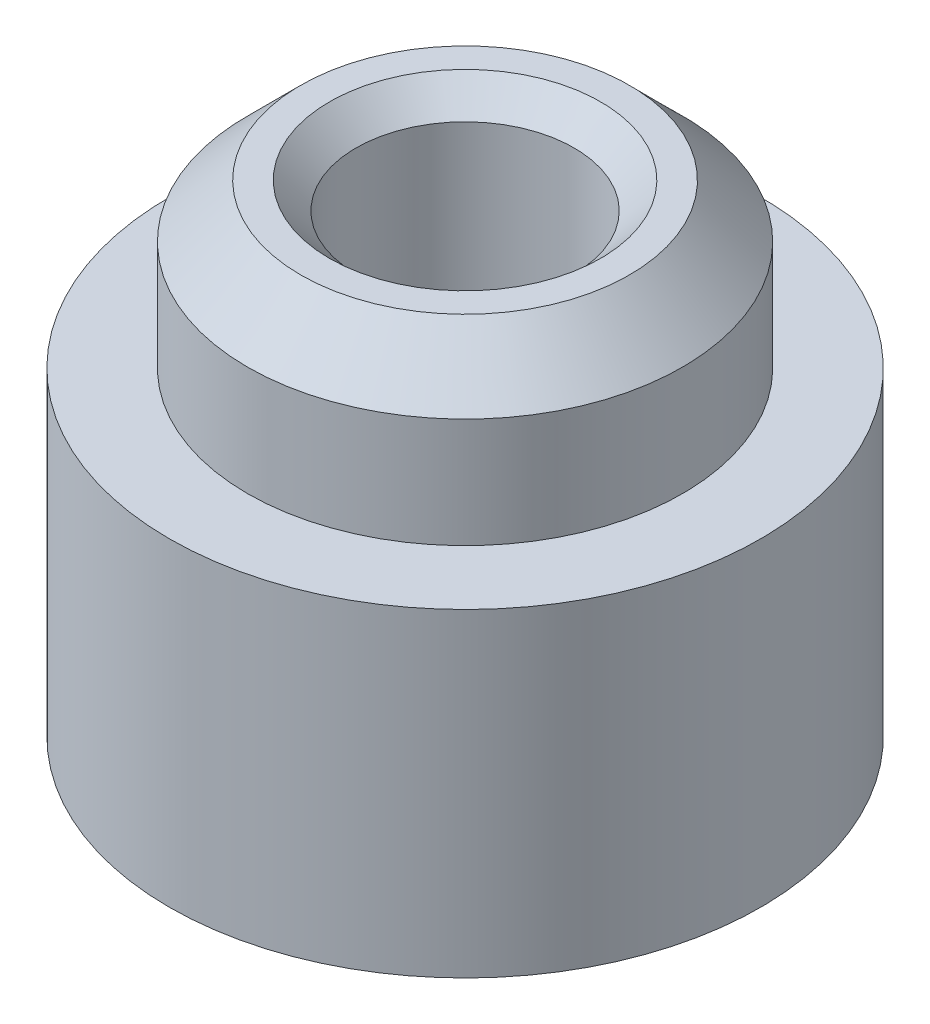
ISO-10303-21;
HEADER;
FILE_DESCRIPTION(('STEP AP214'),'2;1');
FILE_NAME('part.step','',(''),(''),'','','');
FILE_SCHEMA(('AUTOMOTIVE_DESIGN { 1 0 10303 214 1 1 1 1 }'));
ENDSEC;
DATA;
#1=APPLICATION_CONTEXT('core data for automotive mechanical design processes');
#2=APPLICATION_PROTOCOL_DEFINITION('international standard','automotive_design',2000,#1);
#3=PRODUCT_CONTEXT('',#1,'mechanical');
#4=PRODUCT('Part','Part','',(#3));
#5=PRODUCT_RELATED_PRODUCT_CATEGORY('part','',(#4));
#6=PRODUCT_DEFINITION_FORMATION('','',#4);
#7=PRODUCT_DEFINITION_CONTEXT('part definition',#1,'design');
#8=PRODUCT_DEFINITION('design','',#6,#7);
#9=PRODUCT_DEFINITION_SHAPE('','',#8);
#10=(LENGTH_UNIT() NAMED_UNIT(*) SI_UNIT(.MILLI.,.METRE.));
#11=(NAMED_UNIT(*) PLANE_ANGLE_UNIT() SI_UNIT($,.RADIAN.));
#12=(NAMED_UNIT(*) SI_UNIT($,.STERADIAN.) SOLID_ANGLE_UNIT());
#13=UNCERTAINTY_MEASURE_WITH_UNIT(LENGTH_MEASURE(1.E-05),#10,'distance_accuracy_value','');
#14=(GEOMETRIC_REPRESENTATION_CONTEXT(3) GLOBAL_UNCERTAINTY_ASSIGNED_CONTEXT((#13)) GLOBAL_UNIT_ASSIGNED_CONTEXT((#10,
#11,#12)) REPRESENTATION_CONTEXT('',''));
#15=CARTESIAN_POINT('',(0.,0.,0.));
#16=DIRECTION('',(0.,0.,1.));
#17=DIRECTION('',(1.,0.,0.));
#18=AXIS2_PLACEMENT_3D('',#15,#16,#17);
#19=CARTESIAN_POINT('',(0.,1.53,0.));
#20=DIRECTION('',(0.,-1.,0.));
#21=DIRECTION('',(0.,0.,-1.));
#22=AXIS2_PLACEMENT_3D('',#19,#20,#21);
#23=CYLINDRICAL_SURFACE('',#22,2.045);
#24=CARTESIAN_POINT('',(0.,1.03,0.));
#25=DIRECTION('',(0.,1.,0.));
#26=DIRECTION('',(0.,0.,1.));
#27=AXIS2_PLACEMENT_3D('',#24,#25,#26);
#28=CIRCLE('',#27,2.045);
#29=CARTESIAN_POINT('',(0.,1.03,2.045));
#30=VERTEX_POINT('',#29);
#31=EDGE_CURVE('E12',#30,#30,#28,.F.);
#32=ORIENTED_EDGE('',*,*,#31,.T.);
#33=EDGE_LOOP('',(#32));
#34=FACE_BOUND('',#33,.T.);
#35=CARTESIAN_POINT('',(0.,0.,0.));
#36=DIRECTION('',(0.,1.,0.));
#37=DIRECTION('',(0.,0.,1.));
#38=AXIS2_PLACEMENT_3D('',#35,#36,#37);
#39=CIRCLE('',#38,2.045);
#40=CARTESIAN_POINT('',(0.,0.,2.045));
#41=VERTEX_POINT('',#40);
#42=EDGE_CURVE('E53',#41,#41,#39,.T.);
#43=ORIENTED_EDGE('',*,*,#42,.T.);
#44=EDGE_LOOP('',(#43));
#45=FACE_BOUND('',#44,.T.);
#46=ADVANCED_FACE('F41',(#34,#45),#23,.T.);
#47=CARTESIAN_POINT('',(0.,1.53,0.));
#48=DIRECTION('',(0.,1.,0.));
#49=DIRECTION('',(0.,0.,1.));
#50=AXIS2_PLACEMENT_3D('',#47,#48,#49);
#51=PLANE('',#50);
#52=CARTESIAN_POINT('',(0.,1.53,0.));
#53=DIRECTION('',(0.,1.,0.));
#54=DIRECTION('',(0.,0.,1.));
#55=AXIS2_PLACEMENT_3D('',#52,#53,#54);
#56=CIRCLE('',#55,1.275);
#57=CARTESIAN_POINT('',(0.,1.53,1.275));
#58=VERTEX_POINT('',#57);
#59=EDGE_CURVE('E71',#58,#58,#56,.T.);
#60=ORIENTED_EDGE('',*,*,#59,.F.);
#61=EDGE_LOOP('',(#60));
#62=FACE_BOUND('',#61,.T.);
#63=CARTESIAN_POINT('',(0.,1.53,0.));
#64=DIRECTION('',(0.,1.,0.));
#65=DIRECTION('',(0.,0.,1.));
#66=AXIS2_PLACEMENT_3D('',#63,#64,#65);
#67=CIRCLE('',#66,1.545);
#68=CARTESIAN_POINT('',(0.,1.53,1.545));
#69=VERTEX_POINT('',#68);
#70=EDGE_CURVE('E49',#69,#69,#67,.T.);
#71=ORIENTED_EDGE('',*,*,#70,.T.);
#72=EDGE_LOOP('',(#71));
#73=FACE_BOUND('',#72,.T.);
#74=ADVANCED_FACE('F77',(#62,#73),#51,.T.);
#75=CARTESIAN_POINT('',(0.,-3.,0.));
#76=DIRECTION('',(0.,1.,0.));
#77=DIRECTION('',(0.,0.,1.));
#78=AXIS2_PLACEMENT_3D('',#75,#76,#77);
#79=CYLINDRICAL_SURFACE('',#78,2.78);
#80=CARTESIAN_POINT('',(0.,-3.,0.));
#81=DIRECTION('',(0.,1.,0.));
#82=DIRECTION('',(0.,0.,1.));
#83=AXIS2_PLACEMENT_3D('',#80,#81,#82);
#84=CIRCLE('',#83,2.78);
#85=CARTESIAN_POINT('',(0.,-3.,2.78));
#86=VERTEX_POINT('',#85);
#87=EDGE_CURVE('E57',#86,#86,#84,.T.);
#88=ORIENTED_EDGE('',*,*,#87,.T.);
#89=EDGE_LOOP('',(#88));
#90=FACE_BOUND('',#89,.T.);
#91=CARTESIAN_POINT('',(0.,0.,0.));
#92=DIRECTION('',(0.,1.,0.));
#93=DIRECTION('',(0.,0.,1.));
#94=AXIS2_PLACEMENT_3D('',#91,#92,#93);
#95=CIRCLE('',#94,2.78);
#96=CARTESIAN_POINT('',(0.,0.,2.78));
#97=VERTEX_POINT('',#96);
#98=EDGE_CURVE('E60',#97,#97,#95,.T.);
#99=ORIENTED_EDGE('',*,*,#98,.F.);
#100=EDGE_LOOP('',(#99));
#101=FACE_BOUND('',#100,.T.);
#102=ADVANCED_FACE('F79',(#90,#101),#79,.T.);
#103=CARTESIAN_POINT('',(0.,-3.,0.));
#104=DIRECTION('',(0.,1.,0.));
#105=DIRECTION('',(0.,0.,1.));
#106=AXIS2_PLACEMENT_3D('',#103,#104,#105);
#107=PLANE('',#106);
#108=CARTESIAN_POINT('',(0.,-3.,0.));
#109=DIRECTION('',(0.,1.,0.));
#110=DIRECTION('',(0.,0.,1.));
#111=AXIS2_PLACEMENT_3D('',#108,#109,#110);
#112=CIRCLE('',#111,1.025);
#113=CARTESIAN_POINT('',(0.,-3.,1.025));
#114=VERTEX_POINT('',#113);
#115=EDGE_CURVE('E63',#114,#114,#112,.T.);
#116=ORIENTED_EDGE('',*,*,#115,.T.);
#117=EDGE_LOOP('',(#116));
#118=FACE_BOUND('',#117,.T.);
#119=ORIENTED_EDGE('',*,*,#87,.F.);
#120=EDGE_LOOP('',(#119));
#121=FACE_BOUND('',#120,.T.);
#122=ADVANCED_FACE('F85',(#118,#121),#107,.F.);
#123=CARTESIAN_POINT('',(0.,0.,0.));
#124=DIRECTION('',(0.,1.,0.));
#125=DIRECTION('',(0.,0.,1.));
#126=AXIS2_PLACEMENT_3D('',#123,#124,#125);
#127=PLANE('',#126);
#128=ORIENTED_EDGE('',*,*,#42,.F.);
#129=EDGE_LOOP('',(#128));
#130=FACE_BOUND('',#129,.T.);
#131=ORIENTED_EDGE('',*,*,#98,.T.);
#132=EDGE_LOOP('',(#131));
#133=FACE_BOUND('',#132,.T.);
#134=ADVANCED_FACE('F89',(#130,#133),#127,.T.);
#135=CARTESIAN_POINT('',(0.,1.53,0.));
#136=DIRECTION('',(0.,-1.,0.));
#137=DIRECTION('',(0.,0.,-1.));
#138=AXIS2_PLACEMENT_3D('',#135,#136,#137);
#139=CONICAL_SURFACE('',#138,1.545,0.785398163397448);
#140=ORIENTED_EDGE('',*,*,#31,.F.);
#141=EDGE_LOOP('',(#140));
#142=FACE_BOUND('',#141,.T.);
#143=ORIENTED_EDGE('',*,*,#70,.F.);
#144=EDGE_LOOP('',(#143));
#145=FACE_BOUND('',#144,.T.);
#146=ADVANCED_FACE('F44',(#142,#145),#139,.T.);
#147=CARTESIAN_POINT('',(0.,1.53,0.));
#148=DIRECTION('',(0.,1.,0.));
#149=DIRECTION('',(0.,0.,1.));
#150=AXIS2_PLACEMENT_3D('',#147,#148,#149);
#151=CYLINDRICAL_SURFACE('',#150,1.025);
#152=ORIENTED_EDGE('',*,*,#115,.F.);
#153=EDGE_LOOP('',(#152));
#154=FACE_BOUND('',#153,.T.);
#155=CARTESIAN_POINT('',(0.,1.28,0.));
#156=DIRECTION('',(0.,1.,0.));
#157=DIRECTION('',(0.,0.,1.));
#158=AXIS2_PLACEMENT_3D('',#155,#156,#157);
#159=CIRCLE('',#158,1.025);
#160=CARTESIAN_POINT('',(0.,1.28,1.025));
#161=VERTEX_POINT('',#160);
#162=EDGE_CURVE('E68',#161,#161,#159,.T.);
#163=ORIENTED_EDGE('',*,*,#162,.T.);
#164=EDGE_LOOP('',(#163));
#165=FACE_BOUND('',#164,.T.);
#166=ADVANCED_FACE('F96',(#154,#165),#151,.F.);
#167=CARTESIAN_POINT('',(0.,1.53,0.));
#168=DIRECTION('',(0.,1.,0.));
#169=DIRECTION('',(0.,0.,1.));
#170=AXIS2_PLACEMENT_3D('',#167,#168,#169);
#171=CONICAL_SURFACE('',#170,1.275,0.785398163397448);
#172=ORIENTED_EDGE('',*,*,#162,.F.);
#173=EDGE_LOOP('',(#172));
#174=FACE_BOUND('',#173,.T.);
#175=ORIENTED_EDGE('',*,*,#59,.T.);
#176=EDGE_LOOP('',(#175));
#177=FACE_BOUND('',#176,.T.);
#178=ADVANCED_FACE('F75',(#174,#177),#171,.F.);
#179=CLOSED_SHELL('',(#46,#74,#102,#122,#134,#146,#166,#178));
#180=MANIFOLD_SOLID_BREP('B2',#179);
#181=ADVANCED_BREP_SHAPE_REPRESENTATION('',(#18,#180),#14);
#182=SHAPE_DEFINITION_REPRESENTATION(#9,#181);
ENDSEC;
END-ISO-10303-21;
